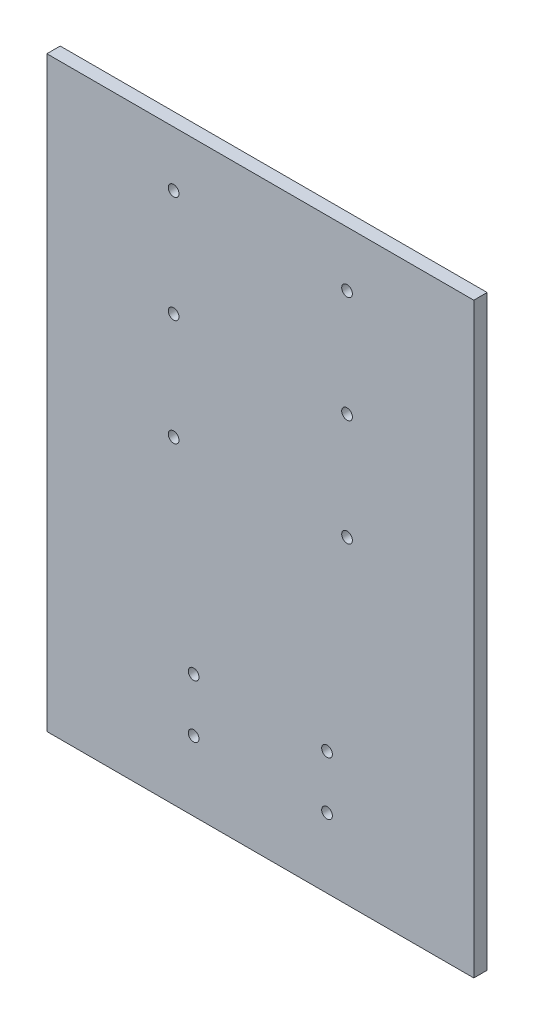
ISO-10303-21;
HEADER;
FILE_DESCRIPTION(('STEP AP214'),'2;1');
FILE_NAME('part.step','',(''),(''),'','','');
FILE_SCHEMA(('AUTOMOTIVE_DESIGN { 1 0 10303 214 1 1 1 1 }'));
ENDSEC;
DATA;
#1=APPLICATION_CONTEXT('core data for automotive mechanical design processes');
#2=APPLICATION_PROTOCOL_DEFINITION('international standard','automotive_design',2000,#1);
#3=PRODUCT_CONTEXT('',#1,'mechanical');
#4=PRODUCT('Part','Part','',(#3));
#5=PRODUCT_RELATED_PRODUCT_CATEGORY('part','',(#4));
#6=PRODUCT_DEFINITION_FORMATION('','',#4);
#7=PRODUCT_DEFINITION_CONTEXT('part definition',#1,'design');
#8=PRODUCT_DEFINITION('design','',#6,#7);
#9=PRODUCT_DEFINITION_SHAPE('','',#8);
#10=(LENGTH_UNIT() NAMED_UNIT(*) SI_UNIT(.MILLI.,.METRE.));
#11=(NAMED_UNIT(*) PLANE_ANGLE_UNIT() SI_UNIT($,.RADIAN.));
#12=(NAMED_UNIT(*) SI_UNIT($,.STERADIAN.) SOLID_ANGLE_UNIT());
#13=UNCERTAINTY_MEASURE_WITH_UNIT(LENGTH_MEASURE(1.E-05),#10,'distance_accuracy_value','');
#14=(GEOMETRIC_REPRESENTATION_CONTEXT(3) GLOBAL_UNCERTAINTY_ASSIGNED_CONTEXT((#13)) GLOBAL_UNIT_ASSIGNED_CONTEXT((#10,
#11,#12)) REPRESENTATION_CONTEXT('',''));
#15=CARTESIAN_POINT('',(0.,0.,0.));
#16=DIRECTION('',(0.,0.,1.));
#17=DIRECTION('',(1.,0.,0.));
#18=AXIS2_PLACEMENT_3D('',#15,#16,#17);
#19=CARTESIAN_POINT('',(0.,0.,6.35));
#20=DIRECTION('',(1.,0.,0.));
#21=DIRECTION('',(0.,0.,-1.));
#22=AXIS2_PLACEMENT_3D('',#19,#20,#21);
#23=PLANE('',#22);
#24=DIRECTION('',(0.,-1.,0.));
#25=VECTOR('',#24,1.);
#26=CARTESIAN_POINT('',(0.,0.,0.));
#27=LINE('',#26,#25);
#28=CARTESIAN_POINT('',(0.,279.4,0.));
#29=VERTEX_POINT('',#28);
#30=CARTESIAN_POINT('',(0.,0.,0.));
#31=VERTEX_POINT('',#30);
#32=EDGE_CURVE('E96',#29,#31,#27,.T.);
#33=ORIENTED_EDGE('',*,*,#32,.T.);
#34=DIRECTION('',(0.,0.,-1.));
#35=VECTOR('',#34,1.);
#36=CARTESIAN_POINT('',(0.,0.,6.35));
#37=LINE('',#36,#35);
#38=CARTESIAN_POINT('',(0.,0.,6.35));
#39=VERTEX_POINT('',#38);
#40=EDGE_CURVE('E11',#39,#31,#37,.T.);
#41=ORIENTED_EDGE('',*,*,#40,.F.);
#42=DIRECTION('',(0.,-1.,0.));
#43=VECTOR('',#42,1.);
#44=CARTESIAN_POINT('',(0.,0.,6.35));
#45=LINE('',#44,#43);
#46=CARTESIAN_POINT('',(0.,279.4,6.35));
#47=VERTEX_POINT('',#46);
#48=EDGE_CURVE('E84',#47,#39,#45,.T.);
#49=ORIENTED_EDGE('',*,*,#48,.F.);
#50=DIRECTION('',(0.,0.,-1.));
#51=VECTOR('',#50,1.);
#52=CARTESIAN_POINT('',(0.,279.4,6.35));
#53=LINE('',#52,#51);
#54=EDGE_CURVE('E92',#47,#29,#53,.T.);
#55=ORIENTED_EDGE('',*,*,#54,.T.);
#56=EDGE_LOOP('',(#33,#41,#49,#55));
#57=FACE_BOUND('',#56,.T.);
#58=ADVANCED_FACE('F33',(#57),#23,.F.);
#59=CARTESIAN_POINT('',(0.,0.,6.35));
#60=DIRECTION('',(0.,1.,0.));
#61=DIRECTION('',(0.,0.,1.));
#62=AXIS2_PLACEMENT_3D('',#59,#60,#61);
#63=PLANE('',#62);
#64=DIRECTION('',(1.,0.,0.));
#65=VECTOR('',#64,1.);
#66=CARTESIAN_POINT('',(0.,0.,0.));
#67=LINE('',#66,#65);
#68=CARTESIAN_POINT('',(203.2,0.,0.));
#69=VERTEX_POINT('',#68);
#70=EDGE_CURVE('E88',#31,#69,#67,.T.);
#71=ORIENTED_EDGE('',*,*,#70,.T.);
#72=DIRECTION('',(0.,0.,-1.));
#73=VECTOR('',#72,1.);
#74=CARTESIAN_POINT('',(203.2,0.,6.35));
#75=LINE('',#74,#73);
#76=CARTESIAN_POINT('',(203.2,0.,6.35));
#77=VERTEX_POINT('',#76);
#78=EDGE_CURVE('E41',#77,#69,#75,.T.);
#79=ORIENTED_EDGE('',*,*,#78,.F.);
#80=DIRECTION('',(1.,0.,0.));
#81=VECTOR('',#80,1.);
#82=CARTESIAN_POINT('',(0.,0.,6.35));
#83=LINE('',#82,#81);
#84=EDGE_CURVE('E79',#39,#77,#83,.T.);
#85=ORIENTED_EDGE('',*,*,#84,.F.);
#86=ORIENTED_EDGE('',*,*,#40,.T.);
#87=EDGE_LOOP('',(#71,#79,#85,#86));
#88=FACE_BOUND('',#87,.T.);
#89=ADVANCED_FACE('F87',(#88),#63,.F.);
#90=CARTESIAN_POINT('',(203.2,0.,6.35));
#91=DIRECTION('',(-1.,0.,0.));
#92=DIRECTION('',(0.,0.,1.));
#93=AXIS2_PLACEMENT_3D('',#90,#91,#92);
#94=PLANE('',#93);
#95=DIRECTION('',(0.,1.,0.));
#96=VECTOR('',#95,1.);
#97=CARTESIAN_POINT('',(203.2,0.,0.));
#98=LINE('',#97,#96);
#99=CARTESIAN_POINT('',(203.2,279.4,0.));
#100=VERTEX_POINT('',#99);
#101=EDGE_CURVE('E66',#69,#100,#98,.T.);
#102=ORIENTED_EDGE('',*,*,#101,.T.);
#103=DIRECTION('',(0.,0.,-1.));
#104=VECTOR('',#103,1.);
#105=CARTESIAN_POINT('',(203.2,279.4,6.35));
#106=LINE('',#105,#104);
#107=CARTESIAN_POINT('',(203.2,279.4,6.35));
#108=VERTEX_POINT('',#107);
#109=EDGE_CURVE('E89',#108,#100,#106,.T.);
#110=ORIENTED_EDGE('',*,*,#109,.F.);
#111=DIRECTION('',(0.,1.,0.));
#112=VECTOR('',#111,1.);
#113=CARTESIAN_POINT('',(203.2,0.,6.35));
#114=LINE('',#113,#112);
#115=EDGE_CURVE('E82',#77,#108,#114,.T.);
#116=ORIENTED_EDGE('',*,*,#115,.F.);
#117=ORIENTED_EDGE('',*,*,#78,.T.);
#118=EDGE_LOOP('',(#102,#110,#116,#117));
#119=FACE_BOUND('',#118,.T.);
#120=ADVANCED_FACE('F90',(#119),#94,.F.);
#121=CARTESIAN_POINT('',(0.,279.4,6.35));
#122=DIRECTION('',(0.,-1.,0.));
#123=DIRECTION('',(0.,0.,-1.));
#124=AXIS2_PLACEMENT_3D('',#121,#122,#123);
#125=PLANE('',#124);
#126=DIRECTION('',(-1.,0.,0.));
#127=VECTOR('',#126,1.);
#128=CARTESIAN_POINT('',(0.,279.4,0.));
#129=LINE('',#128,#127);
#130=EDGE_CURVE('E72',#100,#29,#129,.T.);
#131=ORIENTED_EDGE('',*,*,#130,.T.);
#132=ORIENTED_EDGE('',*,*,#54,.F.);
#133=DIRECTION('',(-1.,0.,0.));
#134=VECTOR('',#133,1.);
#135=CARTESIAN_POINT('',(0.,279.4,6.35));
#136=LINE('',#135,#134);
#137=EDGE_CURVE('E49',#108,#47,#136,.T.);
#138=ORIENTED_EDGE('',*,*,#137,.F.);
#139=ORIENTED_EDGE('',*,*,#109,.T.);
#140=EDGE_LOOP('',(#131,#132,#138,#139));
#141=FACE_BOUND('',#140,.T.);
#142=ADVANCED_FACE('F104',(#141),#125,.F.);
#143=CARTESIAN_POINT('',(0.,0.,6.35));
#144=DIRECTION('',(0.,0.,-1.));
#145=DIRECTION('',(-1.,0.,0.));
#146=AXIS2_PLACEMENT_3D('',#143,#144,#145);
#147=PLANE('',#146);
#148=CARTESIAN_POINT('',(60.325,253.122878716152,6.35));
#149=DIRECTION('',(0.,0.,-1.));
#150=DIRECTION('',(-1.,0.,0.));
#151=AXIS2_PLACEMENT_3D('',#148,#149,#150);
#152=CIRCLE('',#151,2.55269999999999);
#153=CARTESIAN_POINT('',(57.7723,253.122878716152,6.35));
#154=VERTEX_POINT('',#153);
#155=EDGE_CURVE('E163',#154,#154,#152,.T.);
#156=ORIENTED_EDGE('',*,*,#155,.T.);
#157=EDGE_LOOP('',(#156));
#158=FACE_BOUND('',#157,.T.);
#159=CARTESIAN_POINT('',(142.875,253.122878716152,6.35));
#160=DIRECTION('',(0.,0.,-1.));
#161=DIRECTION('',(-1.,0.,0.));
#162=AXIS2_PLACEMENT_3D('',#159,#160,#161);
#163=CIRCLE('',#162,2.55269999999999);
#164=CARTESIAN_POINT('',(140.3223,253.122878716152,6.35));
#165=VERTEX_POINT('',#164);
#166=EDGE_CURVE('E157',#165,#165,#163,.T.);
#167=ORIENTED_EDGE('',*,*,#166,.T.);
#168=EDGE_LOOP('',(#167));
#169=FACE_BOUND('',#168,.T.);
#170=CARTESIAN_POINT('',(142.875,202.322878716152,6.35));
#171=DIRECTION('',(0.,0.,-1.));
#172=DIRECTION('',(-1.,0.,0.));
#173=AXIS2_PLACEMENT_3D('',#170,#171,#172);
#174=CIRCLE('',#173,2.55269999999999);
#175=CARTESIAN_POINT('',(140.3223,202.322878716152,6.35));
#176=VERTEX_POINT('',#175);
#177=EDGE_CURVE('E151',#176,#176,#174,.T.);
#178=ORIENTED_EDGE('',*,*,#177,.T.);
#179=EDGE_LOOP('',(#178));
#180=FACE_BOUND('',#179,.T.);
#181=CARTESIAN_POINT('',(142.875,151.522878716152,6.35));
#182=DIRECTION('',(0.,0.,-1.));
#183=DIRECTION('',(-1.,0.,0.));
#184=AXIS2_PLACEMENT_3D('',#181,#182,#183);
#185=CIRCLE('',#184,2.55269999999999);
#186=CARTESIAN_POINT('',(140.3223,151.522878716152,6.35));
#187=VERTEX_POINT('',#186);
#188=EDGE_CURVE('E145',#187,#187,#185,.T.);
#189=ORIENTED_EDGE('',*,*,#188,.T.);
#190=EDGE_LOOP('',(#189));
#191=FACE_BOUND('',#190,.T.);
#192=CARTESIAN_POINT('',(60.325,151.522878716152,6.35));
#193=DIRECTION('',(0.,0.,-1.));
#194=DIRECTION('',(-1.,0.,0.));
#195=AXIS2_PLACEMENT_3D('',#192,#193,#194);
#196=CIRCLE('',#195,2.55269999999999);
#197=CARTESIAN_POINT('',(57.7723,151.522878716152,6.35));
#198=VERTEX_POINT('',#197);
#199=EDGE_CURVE('E139',#198,#198,#196,.T.);
#200=ORIENTED_EDGE('',*,*,#199,.T.);
#201=EDGE_LOOP('',(#200));
#202=FACE_BOUND('',#201,.T.);
#203=CARTESIAN_POINT('',(60.325,202.322878716152,6.35));
#204=DIRECTION('',(0.,0.,-1.));
#205=DIRECTION('',(-1.,0.,0.));
#206=AXIS2_PLACEMENT_3D('',#203,#204,#205);
#207=CIRCLE('',#206,2.55269999999999);
#208=CARTESIAN_POINT('',(57.7723,202.322878716152,6.35));
#209=VERTEX_POINT('',#208);
#210=EDGE_CURVE('E133',#209,#209,#207,.T.);
#211=ORIENTED_EDGE('',*,*,#210,.T.);
#212=EDGE_LOOP('',(#211));
#213=FACE_BOUND('',#212,.T.);
#214=CARTESIAN_POINT('',(133.349999974,58.5678787161522,6.35));
#215=DIRECTION('',(0.,0.,-1.));
#216=DIRECTION('',(-1.,0.,0.));
#217=AXIS2_PLACEMENT_3D('',#214,#215,#216);
#218=CIRCLE('',#217,2.55269999999999);
#219=CARTESIAN_POINT('',(130.797299974,58.5678787161522,6.35));
#220=VERTEX_POINT('',#219);
#221=EDGE_CURVE('E127',#220,#220,#218,.T.);
#222=ORIENTED_EDGE('',*,*,#221,.T.);
#223=EDGE_LOOP('',(#222));
#224=FACE_BOUND('',#223,.T.);
#225=CARTESIAN_POINT('',(133.349999974,33.1678787161522,6.35));
#226=DIRECTION('',(0.,0.,-1.));
#227=DIRECTION('',(-1.,0.,0.));
#228=AXIS2_PLACEMENT_3D('',#225,#226,#227);
#229=CIRCLE('',#228,2.55269999999999);
#230=CARTESIAN_POINT('',(130.797299974,33.1678787161522,6.35));
#231=VERTEX_POINT('',#230);
#232=EDGE_CURVE('E121',#231,#231,#229,.T.);
#233=ORIENTED_EDGE('',*,*,#232,.T.);
#234=EDGE_LOOP('',(#233));
#235=FACE_BOUND('',#234,.T.);
#236=CARTESIAN_POINT('',(69.849999974,33.1678787161522,6.35));
#237=DIRECTION('',(0.,0.,-1.));
#238=DIRECTION('',(-1.,0.,0.));
#239=AXIS2_PLACEMENT_3D('',#236,#237,#238);
#240=CIRCLE('',#239,2.55269999999999);
#241=CARTESIAN_POINT('',(67.297299974,33.1678787161522,6.35));
#242=VERTEX_POINT('',#241);
#243=EDGE_CURVE('E115',#242,#242,#240,.T.);
#244=ORIENTED_EDGE('',*,*,#243,.T.);
#245=EDGE_LOOP('',(#244));
#246=FACE_BOUND('',#245,.T.);
#247=CARTESIAN_POINT('',(69.849999974,58.5678787161522,6.35));
#248=DIRECTION('',(0.,0.,-1.));
#249=DIRECTION('',(-1.,0.,0.));
#250=AXIS2_PLACEMENT_3D('',#247,#248,#249);
#251=CIRCLE('',#250,2.55269999999999);
#252=CARTESIAN_POINT('',(67.297299974,58.5678787161522,6.35));
#253=VERTEX_POINT('',#252);
#254=EDGE_CURVE('E99',#253,#253,#251,.T.);
#255=ORIENTED_EDGE('',*,*,#254,.T.);
#256=EDGE_LOOP('',(#255));
#257=FACE_BOUND('',#256,.T.);
#258=ORIENTED_EDGE('',*,*,#48,.T.);
#259=ORIENTED_EDGE('',*,*,#84,.T.);
#260=ORIENTED_EDGE('',*,*,#115,.T.);
#261=ORIENTED_EDGE('',*,*,#137,.T.);
#262=EDGE_LOOP('',(#258,#259,#260,#261));
#263=FACE_BOUND('',#262,.T.);
#264=ADVANCED_FACE('F80',(#158,#169,#180,#191,#202,#213,#224,#235,#246,#257,#263),#147,.F.);
#265=CARTESIAN_POINT('',(0.,0.,0.));
#266=DIRECTION('',(0.,0.,-1.));
#267=DIRECTION('',(-1.,0.,0.));
#268=AXIS2_PLACEMENT_3D('',#265,#266,#267);
#269=PLANE('',#268);
#270=CARTESIAN_POINT('',(60.325,253.122878716152,0.));
#271=DIRECTION('',(0.,0.,-1.));
#272=DIRECTION('',(-1.,0.,0.));
#273=AXIS2_PLACEMENT_3D('',#270,#271,#272);
#274=CIRCLE('',#273,2.55269999999999);
#275=CARTESIAN_POINT('',(57.7723,253.122878716152,0.));
#276=VERTEX_POINT('',#275);
#277=EDGE_CURVE('E166',#276,#276,#274,.T.);
#278=ORIENTED_EDGE('',*,*,#277,.F.);
#279=EDGE_LOOP('',(#278));
#280=FACE_BOUND('',#279,.T.);
#281=CARTESIAN_POINT('',(142.875,253.122878716152,0.));
#282=DIRECTION('',(0.,0.,-1.));
#283=DIRECTION('',(-1.,0.,0.));
#284=AXIS2_PLACEMENT_3D('',#281,#282,#283);
#285=CIRCLE('',#284,2.55269999999999);
#286=CARTESIAN_POINT('',(140.3223,253.122878716152,0.));
#287=VERTEX_POINT('',#286);
#288=EDGE_CURVE('E160',#287,#287,#285,.T.);
#289=ORIENTED_EDGE('',*,*,#288,.F.);
#290=EDGE_LOOP('',(#289));
#291=FACE_BOUND('',#290,.T.);
#292=CARTESIAN_POINT('',(142.875,202.322878716152,0.));
#293=DIRECTION('',(0.,0.,-1.));
#294=DIRECTION('',(-1.,0.,0.));
#295=AXIS2_PLACEMENT_3D('',#292,#293,#294);
#296=CIRCLE('',#295,2.55269999999999);
#297=CARTESIAN_POINT('',(140.3223,202.322878716152,0.));
#298=VERTEX_POINT('',#297);
#299=EDGE_CURVE('E154',#298,#298,#296,.T.);
#300=ORIENTED_EDGE('',*,*,#299,.F.);
#301=EDGE_LOOP('',(#300));
#302=FACE_BOUND('',#301,.T.);
#303=CARTESIAN_POINT('',(142.875,151.522878716152,0.));
#304=DIRECTION('',(0.,0.,-1.));
#305=DIRECTION('',(-1.,0.,0.));
#306=AXIS2_PLACEMENT_3D('',#303,#304,#305);
#307=CIRCLE('',#306,2.55269999999999);
#308=CARTESIAN_POINT('',(140.3223,151.522878716152,0.));
#309=VERTEX_POINT('',#308);
#310=EDGE_CURVE('E148',#309,#309,#307,.T.);
#311=ORIENTED_EDGE('',*,*,#310,.F.);
#312=EDGE_LOOP('',(#311));
#313=FACE_BOUND('',#312,.T.);
#314=CARTESIAN_POINT('',(60.325,151.522878716152,0.));
#315=DIRECTION('',(0.,0.,-1.));
#316=DIRECTION('',(-1.,0.,0.));
#317=AXIS2_PLACEMENT_3D('',#314,#315,#316);
#318=CIRCLE('',#317,2.55269999999999);
#319=CARTESIAN_POINT('',(57.7723,151.522878716152,0.));
#320=VERTEX_POINT('',#319);
#321=EDGE_CURVE('E142',#320,#320,#318,.T.);
#322=ORIENTED_EDGE('',*,*,#321,.F.);
#323=EDGE_LOOP('',(#322));
#324=FACE_BOUND('',#323,.T.);
#325=CARTESIAN_POINT('',(60.325,202.322878716152,0.));
#326=DIRECTION('',(0.,0.,-1.));
#327=DIRECTION('',(-1.,0.,0.));
#328=AXIS2_PLACEMENT_3D('',#325,#326,#327);
#329=CIRCLE('',#328,2.55269999999999);
#330=CARTESIAN_POINT('',(57.7723,202.322878716152,0.));
#331=VERTEX_POINT('',#330);
#332=EDGE_CURVE('E136',#331,#331,#329,.T.);
#333=ORIENTED_EDGE('',*,*,#332,.F.);
#334=EDGE_LOOP('',(#333));
#335=FACE_BOUND('',#334,.T.);
#336=CARTESIAN_POINT('',(133.349999974,58.5678787161522,0.));
#337=DIRECTION('',(0.,0.,-1.));
#338=DIRECTION('',(-1.,0.,0.));
#339=AXIS2_PLACEMENT_3D('',#336,#337,#338);
#340=CIRCLE('',#339,2.55269999999999);
#341=CARTESIAN_POINT('',(130.797299974,58.5678787161522,0.));
#342=VERTEX_POINT('',#341);
#343=EDGE_CURVE('E130',#342,#342,#340,.T.);
#344=ORIENTED_EDGE('',*,*,#343,.F.);
#345=EDGE_LOOP('',(#344));
#346=FACE_BOUND('',#345,.T.);
#347=CARTESIAN_POINT('',(133.349999974,33.1678787161522,0.));
#348=DIRECTION('',(0.,0.,-1.));
#349=DIRECTION('',(-1.,0.,0.));
#350=AXIS2_PLACEMENT_3D('',#347,#348,#349);
#351=CIRCLE('',#350,2.55269999999999);
#352=CARTESIAN_POINT('',(130.797299974,33.1678787161522,0.));
#353=VERTEX_POINT('',#352);
#354=EDGE_CURVE('E124',#353,#353,#351,.T.);
#355=ORIENTED_EDGE('',*,*,#354,.F.);
#356=EDGE_LOOP('',(#355));
#357=FACE_BOUND('',#356,.T.);
#358=CARTESIAN_POINT('',(69.849999974,33.1678787161522,0.));
#359=DIRECTION('',(0.,0.,-1.));
#360=DIRECTION('',(-1.,0.,0.));
#361=AXIS2_PLACEMENT_3D('',#358,#359,#360);
#362=CIRCLE('',#361,2.55269999999999);
#363=CARTESIAN_POINT('',(67.297299974,33.1678787161522,0.));
#364=VERTEX_POINT('',#363);
#365=EDGE_CURVE('E118',#364,#364,#362,.T.);
#366=ORIENTED_EDGE('',*,*,#365,.F.);
#367=EDGE_LOOP('',(#366));
#368=FACE_BOUND('',#367,.T.);
#369=CARTESIAN_POINT('',(69.849999974,58.5678787161522,0.));
#370=DIRECTION('',(0.,0.,-1.));
#371=DIRECTION('',(-1.,0.,0.));
#372=AXIS2_PLACEMENT_3D('',#369,#370,#371);
#373=CIRCLE('',#372,2.55269999999999);
#374=CARTESIAN_POINT('',(67.297299974,58.5678787161522,0.));
#375=VERTEX_POINT('',#374);
#376=EDGE_CURVE('E112',#375,#375,#373,.T.);
#377=ORIENTED_EDGE('',*,*,#376,.F.);
#378=EDGE_LOOP('',(#377));
#379=FACE_BOUND('',#378,.T.);
#380=ORIENTED_EDGE('',*,*,#32,.F.);
#381=ORIENTED_EDGE('',*,*,#130,.F.);
#382=ORIENTED_EDGE('',*,*,#101,.F.);
#383=ORIENTED_EDGE('',*,*,#70,.F.);
#384=EDGE_LOOP('',(#380,#381,#382,#383));
#385=FACE_BOUND('',#384,.T.);
#386=ADVANCED_FACE('F107',(#280,#291,#302,#313,#324,#335,#346,#357,#368,#379,#385),#269,.T.);
#387=CARTESIAN_POINT('',(69.849999974,58.5678787161522,0.));
#388=DIRECTION('',(0.,0.,-1.));
#389=DIRECTION('',(-1.,0.,0.));
#390=AXIS2_PLACEMENT_3D('',#387,#388,#389);
#391=CYLINDRICAL_SURFACE('',#390,2.55269999999999);
#392=ORIENTED_EDGE('',*,*,#376,.T.);
#393=EDGE_LOOP('',(#392));
#394=FACE_BOUND('',#393,.T.);
#395=ORIENTED_EDGE('',*,*,#254,.F.);
#396=EDGE_LOOP('',(#395));
#397=FACE_BOUND('',#396,.T.);
#398=ADVANCED_FACE('F175',(#394,#397),#391,.F.);
#399=CARTESIAN_POINT('',(69.849999974,33.1678787161522,0.));
#400=DIRECTION('',(0.,0.,-1.));
#401=DIRECTION('',(-1.,0.,0.));
#402=AXIS2_PLACEMENT_3D('',#399,#400,#401);
#403=CYLINDRICAL_SURFACE('',#402,2.55269999999999);
#404=ORIENTED_EDGE('',*,*,#365,.T.);
#405=EDGE_LOOP('',(#404));
#406=FACE_BOUND('',#405,.T.);
#407=ORIENTED_EDGE('',*,*,#243,.F.);
#408=EDGE_LOOP('',(#407));
#409=FACE_BOUND('',#408,.T.);
#410=ADVANCED_FACE('F197',(#406,#409),#403,.F.);
#411=CARTESIAN_POINT('',(133.349999974,33.1678787161522,0.));
#412=DIRECTION('',(0.,0.,-1.));
#413=DIRECTION('',(-1.,0.,0.));
#414=AXIS2_PLACEMENT_3D('',#411,#412,#413);
#415=CYLINDRICAL_SURFACE('',#414,2.55269999999999);
#416=ORIENTED_EDGE('',*,*,#354,.T.);
#417=EDGE_LOOP('',(#416));
#418=FACE_BOUND('',#417,.T.);
#419=ORIENTED_EDGE('',*,*,#232,.F.);
#420=EDGE_LOOP('',(#419));
#421=FACE_BOUND('',#420,.T.);
#422=ADVANCED_FACE('F243',(#418,#421),#415,.F.);
#423=CARTESIAN_POINT('',(133.349999974,58.5678787161522,0.));
#424=DIRECTION('',(0.,0.,-1.));
#425=DIRECTION('',(-1.,0.,0.));
#426=AXIS2_PLACEMENT_3D('',#423,#424,#425);
#427=CYLINDRICAL_SURFACE('',#426,2.55269999999999);
#428=ORIENTED_EDGE('',*,*,#343,.T.);
#429=EDGE_LOOP('',(#428));
#430=FACE_BOUND('',#429,.T.);
#431=ORIENTED_EDGE('',*,*,#221,.F.);
#432=EDGE_LOOP('',(#431));
#433=FACE_BOUND('',#432,.T.);
#434=ADVANCED_FACE('F251',(#430,#433),#427,.F.);
#435=CARTESIAN_POINT('',(60.325,202.322878716152,0.));
#436=DIRECTION('',(0.,0.,-1.));
#437=DIRECTION('',(-1.,0.,0.));
#438=AXIS2_PLACEMENT_3D('',#435,#436,#437);
#439=CYLINDRICAL_SURFACE('',#438,2.55269999999999);
#440=ORIENTED_EDGE('',*,*,#332,.T.);
#441=EDGE_LOOP('',(#440));
#442=FACE_BOUND('',#441,.T.);
#443=ORIENTED_EDGE('',*,*,#210,.F.);
#444=EDGE_LOOP('',(#443));
#445=FACE_BOUND('',#444,.T.);
#446=ADVANCED_FACE('F259',(#442,#445),#439,.F.);
#447=CARTESIAN_POINT('',(60.325,151.522878716152,0.));
#448=DIRECTION('',(0.,0.,-1.));
#449=DIRECTION('',(-1.,0.,0.));
#450=AXIS2_PLACEMENT_3D('',#447,#448,#449);
#451=CYLINDRICAL_SURFACE('',#450,2.55269999999999);
#452=ORIENTED_EDGE('',*,*,#321,.T.);
#453=EDGE_LOOP('',(#452));
#454=FACE_BOUND('',#453,.T.);
#455=ORIENTED_EDGE('',*,*,#199,.F.);
#456=EDGE_LOOP('',(#455));
#457=FACE_BOUND('',#456,.T.);
#458=ADVANCED_FACE('F267',(#454,#457),#451,.F.);
#459=CARTESIAN_POINT('',(142.875,151.522878716152,0.));
#460=DIRECTION('',(0.,0.,-1.));
#461=DIRECTION('',(-1.,0.,0.));
#462=AXIS2_PLACEMENT_3D('',#459,#460,#461);
#463=CYLINDRICAL_SURFACE('',#462,2.55269999999999);
#464=ORIENTED_EDGE('',*,*,#310,.T.);
#465=EDGE_LOOP('',(#464));
#466=FACE_BOUND('',#465,.T.);
#467=ORIENTED_EDGE('',*,*,#188,.F.);
#468=EDGE_LOOP('',(#467));
#469=FACE_BOUND('',#468,.T.);
#470=ADVANCED_FACE('F275',(#466,#469),#463,.F.);
#471=CARTESIAN_POINT('',(142.875,202.322878716152,0.));
#472=DIRECTION('',(0.,0.,-1.));
#473=DIRECTION('',(-1.,0.,0.));
#474=AXIS2_PLACEMENT_3D('',#471,#472,#473);
#475=CYLINDRICAL_SURFACE('',#474,2.55269999999999);
#476=ORIENTED_EDGE('',*,*,#299,.T.);
#477=EDGE_LOOP('',(#476));
#478=FACE_BOUND('',#477,.T.);
#479=ORIENTED_EDGE('',*,*,#177,.F.);
#480=EDGE_LOOP('',(#479));
#481=FACE_BOUND('',#480,.T.);
#482=ADVANCED_FACE('F283',(#478,#481),#475,.F.);
#483=CARTESIAN_POINT('',(142.875,253.122878716152,0.));
#484=DIRECTION('',(0.,0.,-1.));
#485=DIRECTION('',(-1.,0.,0.));
#486=AXIS2_PLACEMENT_3D('',#483,#484,#485);
#487=CYLINDRICAL_SURFACE('',#486,2.55269999999999);
#488=ORIENTED_EDGE('',*,*,#288,.T.);
#489=EDGE_LOOP('',(#488));
#490=FACE_BOUND('',#489,.T.);
#491=ORIENTED_EDGE('',*,*,#166,.F.);
#492=EDGE_LOOP('',(#491));
#493=FACE_BOUND('',#492,.T.);
#494=ADVANCED_FACE('F291',(#490,#493),#487,.F.);
#495=CARTESIAN_POINT('',(60.325,253.122878716152,0.));
#496=DIRECTION('',(0.,0.,-1.));
#497=DIRECTION('',(-1.,0.,0.));
#498=AXIS2_PLACEMENT_3D('',#495,#496,#497);
#499=CYLINDRICAL_SURFACE('',#498,2.55269999999999);
#500=ORIENTED_EDGE('',*,*,#277,.T.);
#501=EDGE_LOOP('',(#500));
#502=FACE_BOUND('',#501,.T.);
#503=ORIENTED_EDGE('',*,*,#155,.F.);
#504=EDGE_LOOP('',(#503));
#505=FACE_BOUND('',#504,.T.);
#506=ADVANCED_FACE('F170',(#502,#505),#499,.F.);
#507=CLOSED_SHELL('',(#58,#89,#120,#142,#264,#386,#398,#410,#422,#434,#446,#458,#470,#482,#494,#506));
#508=MANIFOLD_SOLID_BREP('B2',#507);
#509=ADVANCED_BREP_SHAPE_REPRESENTATION('',(#18,#508),#14);
#510=SHAPE_DEFINITION_REPRESENTATION(#9,#509);
ENDSEC;
END-ISO-10303-21;
